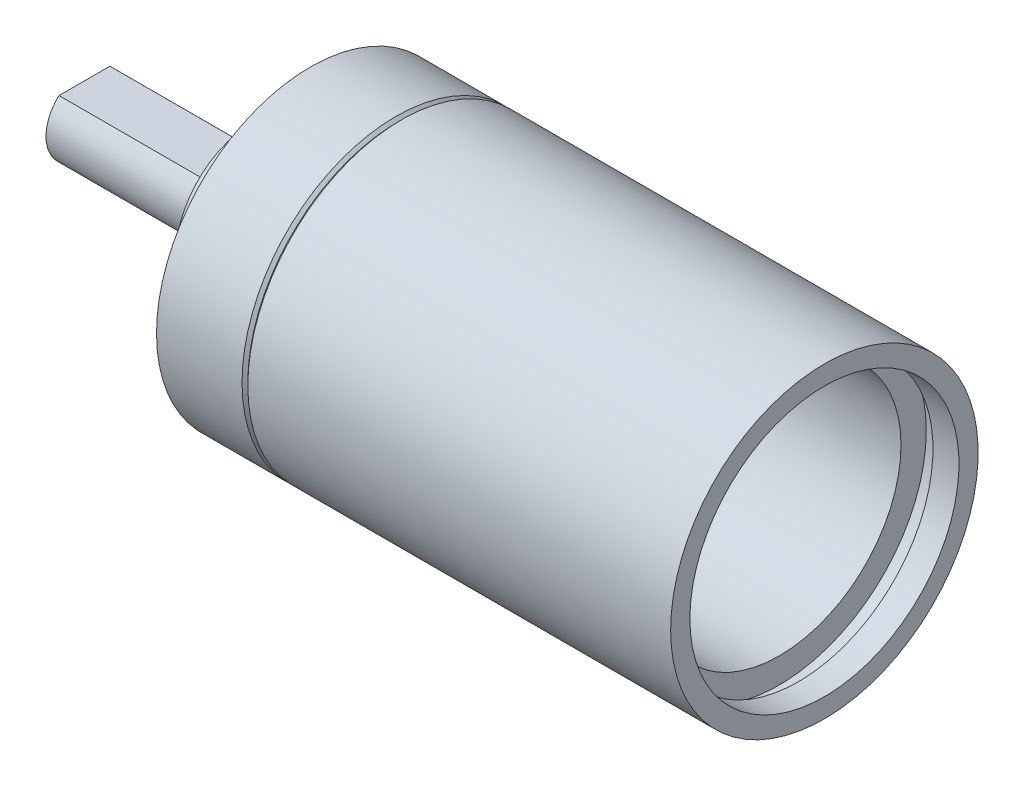
ISO-10303-21;
HEADER;
FILE_DESCRIPTION(('STEP AP214'),'2;1');
FILE_NAME('part.step','',(''),(''),'','','');
FILE_SCHEMA(('AUTOMOTIVE_DESIGN { 1 0 10303 214 1 1 1 1 }'));
ENDSEC;
DATA;
#1=APPLICATION_CONTEXT('core data for automotive mechanical design processes');
#2=APPLICATION_PROTOCOL_DEFINITION('international standard','automotive_design',2000,#1);
#3=PRODUCT_CONTEXT('',#1,'mechanical');
#4=PRODUCT('Part','Part','',(#3));
#5=PRODUCT_RELATED_PRODUCT_CATEGORY('part','',(#4));
#6=PRODUCT_DEFINITION_FORMATION('','',#4);
#7=PRODUCT_DEFINITION_CONTEXT('part definition',#1,'design');
#8=PRODUCT_DEFINITION('design','',#6,#7);
#9=PRODUCT_DEFINITION_SHAPE('','',#8);
#10=(LENGTH_UNIT() NAMED_UNIT(*) SI_UNIT(.MILLI.,.METRE.));
#11=(NAMED_UNIT(*) PLANE_ANGLE_UNIT() SI_UNIT($,.RADIAN.));
#12=(NAMED_UNIT(*) SI_UNIT($,.STERADIAN.) SOLID_ANGLE_UNIT());
#13=UNCERTAINTY_MEASURE_WITH_UNIT(LENGTH_MEASURE(1.E-05),#10,'distance_accuracy_value','');
#14=(GEOMETRIC_REPRESENTATION_CONTEXT(3) GLOBAL_UNCERTAINTY_ASSIGNED_CONTEXT((#13)) GLOBAL_UNIT_ASSIGNED_CONTEXT((#10,
#11,#12)) REPRESENTATION_CONTEXT('',''));
#15=CARTESIAN_POINT('',(0.,0.,0.));
#16=DIRECTION('',(0.,0.,1.));
#17=DIRECTION('',(1.,0.,0.));
#18=AXIS2_PLACEMENT_3D('',#15,#16,#17);
#19=CARTESIAN_POINT('',(-30.5,1.5,-5.));
#20=DIRECTION('',(0.707106781186548,-0.707106781186548,0.));
#21=DIRECTION('',(0.707106781186548,0.707106781186547,0.));
#22=AXIS2_PLACEMENT_3D('',#19,#20,#21);
#23=PLANE('',#22);
#24=CARTESIAN_POINT('',(-32.,0.,0.));
#25=DIRECTION('',(0.707106781186548,-0.707106781186548,0.));
#26=DIRECTION('',(-0.707106781186548,-0.707106781186547,0.));
#27=AXIS2_PLACEMENT_3D('',#24,#25,#26);
#28=ELLIPSE('',#27,2.82842712474619,2.);
#29=CARTESIAN_POINT('',(-30.5,1.50000000000007,-1.32287565553222));
#30=VERTEX_POINT('',#29);
#31=CARTESIAN_POINT('',(-30.5,1.50000000000007,1.32287565553221));
#32=VERTEX_POINT('',#31);
#33=EDGE_CURVE('E19',#30,#32,#28,.T.);
#34=ORIENTED_EDGE('',*,*,#33,.F.);
#35=DIRECTION('',(0.,0.,-1.));
#36=VECTOR('',#35,1.);
#37=CARTESIAN_POINT('',(-30.5,1.5,-5.));
#38=LINE('',#37,#36);
#39=EDGE_CURVE('E60',#30,#32,#38,.F.);
#40=ORIENTED_EDGE('',*,*,#39,.T.);
#41=EDGE_LOOP('',(#34,#40));
#42=FACE_BOUND('',#41,.T.);
#43=ADVANCED_FACE('F16',(#42),#23,.F.);
#44=CARTESIAN_POINT('',(-38.5000000000001,0.,0.));
#45=DIRECTION('',(-1.,0.,0.));
#46=DIRECTION('',(0.,0.,1.));
#47=AXIS2_PLACEMENT_3D('',#44,#45,#46);
#48=PLANE('',#47);
#49=CARTESIAN_POINT('',(-38.5000000000001,0.,0.));
#50=DIRECTION('',(-1.,0.,0.));
#51=DIRECTION('',(0.,0.,1.));
#52=AXIS2_PLACEMENT_3D('',#49,#50,#51);
#53=CIRCLE('',#52,2.);
#54=CARTESIAN_POINT('',(-38.5,1.50000000000007,1.32287565553221));
#55=VERTEX_POINT('',#54);
#56=CARTESIAN_POINT('',(-38.5,1.50000000000006,-1.32287565553221));
#57=VERTEX_POINT('',#56);
#58=EDGE_CURVE('E72',#55,#57,#53,.F.);
#59=ORIENTED_EDGE('',*,*,#58,.F.);
#60=DIRECTION('',(0.,0.,-1.));
#61=VECTOR('',#60,1.);
#62=CARTESIAN_POINT('',(-38.5,1.5,-5.));
#63=LINE('',#62,#61);
#64=EDGE_CURVE('E69',#55,#57,#63,.T.);
#65=ORIENTED_EDGE('',*,*,#64,.T.);
#66=EDGE_LOOP('',(#59,#65));
#67=FACE_BOUND('',#66,.T.);
#68=ADVANCED_FACE('F395',(#67),#48,.T.);
#69=CARTESIAN_POINT('',(-38.5,1.5,-5.));
#70=DIRECTION('',(0.,-1.,0.));
#71=DIRECTION('',(0.,0.,-1.));
#72=AXIS2_PLACEMENT_3D('',#69,#70,#71);
#73=PLANE('',#72);
#74=DIRECTION('',(-1.,0.,0.));
#75=VECTOR('',#74,1.);
#76=CARTESIAN_POINT('',(1.92500000000001,1.50000000000014,1.32287565553212));
#77=LINE('',#76,#75);
#78=EDGE_CURVE('E68',#32,#55,#77,.T.);
#79=ORIENTED_EDGE('',*,*,#78,.F.);
#80=ORIENTED_EDGE('',*,*,#39,.F.);
#81=DIRECTION('',(-1.,0.,0.));
#82=VECTOR('',#81,1.);
#83=CARTESIAN_POINT('',(1.92499999999995,1.50000000000014,-1.32287565553214));
#84=LINE('',#83,#82);
#85=EDGE_CURVE('E66',#57,#30,#84,.F.);
#86=ORIENTED_EDGE('',*,*,#85,.F.);
#87=ORIENTED_EDGE('',*,*,#64,.F.);
#88=EDGE_LOOP('',(#79,#80,#86,#87));
#89=FACE_BOUND('',#88,.T.);
#90=ADVANCED_FACE('F64',(#89),#73,.F.);
#91=CARTESIAN_POINT('',(1.92499999999995,0.,0.));
#92=DIRECTION('',(-1.,0.,0.));
#93=DIRECTION('',(0.,0.,1.));
#94=AXIS2_PLACEMENT_3D('',#91,#92,#93);
#95=CYLINDRICAL_SURFACE('',#94,2.);
#96=CARTESIAN_POINT('',(-29.7500000000001,0.,0.));
#97=DIRECTION('',(-1.,0.,0.));
#98=DIRECTION('',(0.,0.,1.));
#99=AXIS2_PLACEMENT_3D('',#96,#97,#98);
#100=CIRCLE('',#99,2.);
#101=CARTESIAN_POINT('',(-29.7500000000001,0.,1.99999999999999));
#102=VERTEX_POINT('',#101);
#103=EDGE_CURVE('E73',#102,#102,#100,.F.);
#104=ORIENTED_EDGE('',*,*,#103,.F.);
#105=EDGE_LOOP('',(#104));
#106=FACE_BOUND('',#105,.T.);
#107=ORIENTED_EDGE('',*,*,#58,.T.);
#108=ORIENTED_EDGE('',*,*,#85,.T.);
#109=ORIENTED_EDGE('',*,*,#33,.T.);
#110=ORIENTED_EDGE('',*,*,#78,.T.);
#111=EDGE_LOOP('',(#107,#108,#109,#110));
#112=FACE_BOUND('',#111,.T.);
#113=ADVANCED_FACE('F71',(#106,#112),#95,.T.);
#114=CARTESIAN_POINT('',(-29.7500000000001,0.,0.));
#115=DIRECTION('',(-1.,0.,0.));
#116=DIRECTION('',(0.,0.,1.));
#117=AXIS2_PLACEMENT_3D('',#114,#115,#116);
#118=PLANE('',#117);
#119=ORIENTED_EDGE('',*,*,#103,.T.);
#120=EDGE_LOOP('',(#119));
#121=FACE_BOUND('',#120,.T.);
#122=CARTESIAN_POINT('',(-29.7500000000001,0.,0.));
#123=DIRECTION('',(-1.,0.,0.));
#124=DIRECTION('',(0.,0.,1.));
#125=AXIS2_PLACEMENT_3D('',#122,#123,#124);
#126=CIRCLE('',#125,4.);
#127=CARTESIAN_POINT('',(-29.7500000000001,0.,3.99999999999999));
#128=VERTEX_POINT('',#127);
#129=EDGE_CURVE('E76',#128,#128,#126,.F.);
#130=ORIENTED_EDGE('',*,*,#129,.F.);
#131=EDGE_LOOP('',(#130));
#132=FACE_BOUND('',#131,.T.);
#133=ADVANCED_FACE('F143',(#121,#132),#118,.T.);
#134=CARTESIAN_POINT('',(-21.7000000000001,0.,0.));
#135=DIRECTION('',(-1.,0.,0.));
#136=DIRECTION('',(0.,0.,1.));
#137=AXIS2_PLACEMENT_3D('',#134,#135,#136);
#138=PLANE('',#137);
#139=CARTESIAN_POINT('',(-21.7000000000001,0.,0.));
#140=DIRECTION('',(-1.,0.,0.));
#141=DIRECTION('',(0.,0.,1.));
#142=AXIS2_PLACEMENT_3D('',#139,#140,#141);
#143=CIRCLE('',#142,6.335);
#144=CARTESIAN_POINT('',(-21.7000000000001,0.,6.33499999999999));
#145=VERTEX_POINT('',#144);
#146=EDGE_CURVE('E134',#145,#145,#143,.F.);
#147=ORIENTED_EDGE('',*,*,#146,.T.);
#148=EDGE_LOOP('',(#147));
#149=FACE_BOUND('',#148,.T.);
#150=ADVANCED_FACE('F145',(#149),#138,.F.);
#151=CARTESIAN_POINT('',(1.92499999999995,0.,0.));
#152=DIRECTION('',(-1.,0.,0.));
#153=DIRECTION('',(0.,0.,1.));
#154=AXIS2_PLACEMENT_3D('',#151,#152,#153);
#155=CYLINDRICAL_SURFACE('',#154,4.);
#156=ORIENTED_EDGE('',*,*,#129,.T.);
#157=EDGE_LOOP('',(#156));
#158=FACE_BOUND('',#157,.T.);
#159=CARTESIAN_POINT('',(-27.9,0.,0.));
#160=DIRECTION('',(-1.,0.,0.));
#161=DIRECTION('',(0.,0.,1.));
#162=AXIS2_PLACEMENT_3D('',#159,#160,#161);
#163=CIRCLE('',#162,4.);
#164=CARTESIAN_POINT('',(-27.9,0.,3.99999999999999));
#165=VERTEX_POINT('',#164);
#166=EDGE_CURVE('E131',#165,#165,#163,.F.);
#167=ORIENTED_EDGE('',*,*,#166,.F.);
#168=EDGE_LOOP('',(#167));
#169=FACE_BOUND('',#168,.T.);
#170=ADVANCED_FACE('F140',(#158,#169),#155,.T.);
#171=CARTESIAN_POINT('',(1.92499999999995,0.,0.));
#172=DIRECTION('',(-1.,0.,0.));
#173=DIRECTION('',(0.,0.,1.));
#174=AXIS2_PLACEMENT_3D('',#171,#172,#173);
#175=CYLINDRICAL_SURFACE('',#174,6.335);
#176=CARTESIAN_POINT('',(-2.35000000000002,0.,0.));
#177=DIRECTION('',(-1.,0.,0.));
#178=DIRECTION('',(0.,0.,1.));
#179=AXIS2_PLACEMENT_3D('',#176,#177,#178);
#180=CIRCLE('',#179,6.335);
#181=CARTESIAN_POINT('',(-2.35000000000002,0.,6.33499999999999));
#182=VERTEX_POINT('',#181);
#183=EDGE_CURVE('E128',#182,#182,#180,.F.);
#184=ORIENTED_EDGE('',*,*,#183,.T.);
#185=EDGE_LOOP('',(#184));
#186=FACE_BOUND('',#185,.T.);
#187=ORIENTED_EDGE('',*,*,#146,.F.);
#188=EDGE_LOOP('',(#187));
#189=FACE_BOUND('',#188,.T.);
#190=ADVANCED_FACE('F256',(#186,#189),#175,.F.);
#191=CARTESIAN_POINT('',(-27.9,0.,0.));
#192=DIRECTION('',(-1.,0.,0.));
#193=DIRECTION('',(0.,0.,1.));
#194=AXIS2_PLACEMENT_3D('',#191,#192,#193);
#195=PLANE('',#194);
#196=ORIENTED_EDGE('',*,*,#166,.T.);
#197=EDGE_LOOP('',(#196));
#198=FACE_BOUND('',#197,.T.);
#199=CARTESIAN_POINT('',(-27.9,0.,0.));
#200=DIRECTION('',(-1.,0.,0.));
#201=DIRECTION('',(0.,0.,1.));
#202=AXIS2_PLACEMENT_3D('',#199,#200,#201);
#203=CIRCLE('',#202,5.);
#204=CARTESIAN_POINT('',(-27.9,0.,4.99999999999999));
#205=VERTEX_POINT('',#204);
#206=EDGE_CURVE('E125',#205,#205,#203,.F.);
#207=ORIENTED_EDGE('',*,*,#206,.F.);
#208=EDGE_LOOP('',(#207));
#209=FACE_BOUND('',#208,.T.);
#210=ADVANCED_FACE('F252',(#198,#209),#195,.T.);
#211=CARTESIAN_POINT('',(-22.8727487385641,6.5,0.));
#212=DIRECTION('',(-1.,0.,0.));
#213=DIRECTION('',(0.,0.,1.));
#214=AXIS2_PLACEMENT_3D('',#211,#212,#213);
#215=CONICAL_SURFACE('',#214,0.869999999980336,1.02974425839299);
#216=CARTESIAN_POINT('',(-22.8727487385501,6.5,0.));
#217=DIRECTION('',(1.,0.,0.));
#218=DIRECTION('',(0.,0.,-1.));
#219=AXIS2_PLACEMENT_3D('',#216,#217,#218);
#220=CIRCLE('',#219,0.87);
#221=CARTESIAN_POINT('',(-22.8727487385501,6.5,-0.870000000000007));
#222=VERTEX_POINT('',#221);
#223=EDGE_CURVE('E80',#222,#222,#220,.F.);
#224=ORIENTED_EDGE('',*,*,#223,.T.);
#225=EDGE_LOOP('',(#224));
#226=FACE_BOUND('',#225,.T.);
#227=CARTESIAN_POINT('',(-22.3499999999604,6.49999999973261,0.));
#228=VERTEX_POINT('',#227);
#229=VERTEX_LOOP('',#228);
#230=FACE_BOUND('',#229,.T.);
#231=ADVANCED_FACE('F248',(#226,#230),#215,.F.);
#232=CARTESIAN_POINT('',(-22.8727487385072,3.25,5.629165124599));
#233=DIRECTION('',(-1.,0.,0.));
#234=DIRECTION('',(0.,0.,1.));
#235=AXIS2_PLACEMENT_3D('',#232,#233,#234);
#236=CONICAL_SURFACE('',#235,0.869999999887644,1.02974425842671);
#237=CARTESIAN_POINT('',(-22.8727487385501,3.25,5.629165124599));
#238=DIRECTION('',(1.,0.,0.));
#239=DIRECTION('',(0.,0.,-1.));
#240=AXIS2_PLACEMENT_3D('',#237,#238,#239);
#241=CIRCLE('',#240,0.87);
#242=CARTESIAN_POINT('',(-22.8727487385501,3.25,4.759165124599));
#243=VERTEX_POINT('',#242);
#244=EDGE_CURVE('E687',#243,#243,#241,.F.);
#245=ORIENTED_EDGE('',*,*,#244,.T.);
#246=EDGE_LOOP('',(#245));
#247=FACE_BOUND('',#246,.T.);
#248=CARTESIAN_POINT('',(-22.3499999999603,3.25000000005683,5.62916512468426));
#249=VERTEX_POINT('',#248);
#250=VERTEX_LOOP('',#249);
#251=FACE_BOUND('',#250,.T.);
#252=ADVANCED_FACE('F244',(#247,#251),#236,.F.);
#253=CARTESIAN_POINT('',(-22.8727487385072,-3.25,5.62916512459899));
#254=DIRECTION('',(-1.,0.,0.));
#255=DIRECTION('',(0.,0.,1.));
#256=AXIS2_PLACEMENT_3D('',#253,#254,#255);
#257=CONICAL_SURFACE('',#256,0.869999999887644,1.02974425842671);
#258=CARTESIAN_POINT('',(-22.8727487385501,-3.25000000000001,5.62916512459899));
#259=DIRECTION('',(1.,0.,0.));
#260=DIRECTION('',(0.,0.,-1.));
#261=AXIS2_PLACEMENT_3D('',#258,#259,#260);
#262=CIRCLE('',#261,0.87);
#263=CARTESIAN_POINT('',(-22.8727487385501,-3.25000000000001,4.75916512459899));
#264=VERTEX_POINT('',#263);
#265=EDGE_CURVE('E685',#264,#264,#262,.F.);
#266=ORIENTED_EDGE('',*,*,#265,.T.);
#267=EDGE_LOOP('',(#266));
#268=FACE_BOUND('',#267,.T.);
#269=CARTESIAN_POINT('',(-22.3499999999035,-3.25,5.629165124599));
#270=VERTEX_POINT('',#269);
#271=VERTEX_LOOP('',#270);
#272=FACE_BOUND('',#271,.T.);
#273=ADVANCED_FACE('F240',(#268,#272),#257,.F.);
#274=CARTESIAN_POINT('',(-22.872748738564,-6.5,0.));
#275=DIRECTION('',(-1.,0.,0.));
#276=DIRECTION('',(0.,0.,1.));
#277=AXIS2_PLACEMENT_3D('',#274,#275,#276);
#278=CONICAL_SURFACE('',#277,0.869999999980336,1.02974425839299);
#279=CARTESIAN_POINT('',(-22.8727487385501,-6.50000000000001,0.));
#280=DIRECTION('',(1.,0.,0.));
#281=DIRECTION('',(0.,0.,-1.));
#282=AXIS2_PLACEMENT_3D('',#279,#280,#281);
#283=CIRCLE('',#282,0.87);
#284=CARTESIAN_POINT('',(-22.8727487385501,-6.50000000000001,-0.87));
#285=VERTEX_POINT('',#284);
#286=EDGE_CURVE('E682',#285,#285,#283,.F.);
#287=ORIENTED_EDGE('',*,*,#286,.T.);
#288=EDGE_LOOP('',(#287));
#289=FACE_BOUND('',#288,.T.);
#290=CARTESIAN_POINT('',(-22.3499999999603,-6.49999999973261,0.));
#291=VERTEX_POINT('',#290);
#292=VERTEX_LOOP('',#291);
#293=FACE_BOUND('',#292,.T.);
#294=ADVANCED_FACE('F236',(#289,#293),#278,.F.);
#295=CARTESIAN_POINT('',(-22.8727487385073,-3.25,-5.62916512459901));
#296=DIRECTION('',(-1.,0.,0.));
#297=DIRECTION('',(0.,0.,1.));
#298=AXIS2_PLACEMENT_3D('',#295,#296,#297);
#299=CONICAL_SURFACE('',#298,0.869999999887644,1.02974425842671);
#300=CARTESIAN_POINT('',(-22.8727487385501,-3.25,-5.629165124599));
#301=DIRECTION('',(1.,0.,0.));
#302=DIRECTION('',(0.,0.,-1.));
#303=AXIS2_PLACEMENT_3D('',#300,#301,#302);
#304=CIRCLE('',#303,0.87);
#305=CARTESIAN_POINT('',(-22.8727487385501,-3.25,-6.499165124599));
#306=VERTEX_POINT('',#305);
#307=EDGE_CURVE('E679',#306,#306,#304,.F.);
#308=ORIENTED_EDGE('',*,*,#307,.T.);
#309=EDGE_LOOP('',(#308));
#310=FACE_BOUND('',#309,.T.);
#311=CARTESIAN_POINT('',(-22.3499999999603,-3.25000000005685,-5.62916512468427));
#312=VERTEX_POINT('',#311);
#313=VERTEX_LOOP('',#312);
#314=FACE_BOUND('',#313,.T.);
#315=ADVANCED_FACE('F232',(#310,#314),#299,.F.);
#316=CARTESIAN_POINT('',(-22.8727487385073,3.25,-5.629165124599));
#317=DIRECTION('',(-1.,0.,0.));
#318=DIRECTION('',(0.,0.,1.));
#319=AXIS2_PLACEMENT_3D('',#316,#317,#318);
#320=CONICAL_SURFACE('',#319,0.869999999887644,1.02974425842671);
#321=CARTESIAN_POINT('',(-22.8727487385501,3.25,-5.62916512459901));
#322=DIRECTION('',(1.,0.,0.));
#323=DIRECTION('',(0.,0.,-1.));
#324=AXIS2_PLACEMENT_3D('',#321,#322,#323);
#325=CIRCLE('',#324,0.87);
#326=CARTESIAN_POINT('',(-22.8727487385501,3.25,-6.49916512459901));
#327=VERTEX_POINT('',#326);
#328=EDGE_CURVE('E124',#327,#327,#325,.F.);
#329=ORIENTED_EDGE('',*,*,#328,.T.);
#330=EDGE_LOOP('',(#329));
#331=FACE_BOUND('',#330,.T.);
#332=CARTESIAN_POINT('',(-22.3499999999035,3.25,-5.629165124599));
#333=VERTEX_POINT('',#332);
#334=VERTEX_LOOP('',#333);
#335=FACE_BOUND('',#334,.T.);
#336=ADVANCED_FACE('F228',(#331,#335),#320,.F.);
#337=CARTESIAN_POINT('',(-2.35000000000002,0.,0.));
#338=DIRECTION('',(-1.,0.,0.));
#339=DIRECTION('',(0.,0.,1.));
#340=AXIS2_PLACEMENT_3D('',#337,#338,#339);
#341=PLANE('',#340);
#342=ORIENTED_EDGE('',*,*,#183,.F.);
#343=EDGE_LOOP('',(#342));
#344=FACE_BOUND('',#343,.T.);
#345=CARTESIAN_POINT('',(-2.35000000000002,0.,0.));
#346=DIRECTION('',(-1.,0.,0.));
#347=DIRECTION('',(0.,0.,1.));
#348=AXIS2_PLACEMENT_3D('',#345,#346,#347);
#349=CIRCLE('',#348,7.65);
#350=CARTESIAN_POINT('',(-2.35000000000002,0.,7.64999999999999));
#351=VERTEX_POINT('',#350);
#352=EDGE_CURVE('E121',#351,#351,#349,.F.);
#353=ORIENTED_EDGE('',*,*,#352,.T.);
#354=EDGE_LOOP('',(#353));
#355=FACE_BOUND('',#354,.T.);
#356=ADVANCED_FACE('F224',(#344,#355),#341,.F.);
#357=CARTESIAN_POINT('',(1.92499999999995,0.,0.));
#358=DIRECTION('',(-1.,0.,0.));
#359=DIRECTION('',(0.,0.,1.));
#360=AXIS2_PLACEMENT_3D('',#357,#358,#359);
#361=CYLINDRICAL_SURFACE('',#360,5.);
#362=ORIENTED_EDGE('',*,*,#206,.T.);
#363=EDGE_LOOP('',(#362));
#364=FACE_BOUND('',#363,.T.);
#365=CARTESIAN_POINT('',(-26.75,0.,0.));
#366=DIRECTION('',(-1.,0.,0.));
#367=DIRECTION('',(0.,0.,1.));
#368=AXIS2_PLACEMENT_3D('',#365,#366,#367);
#369=CIRCLE('',#368,5.);
#370=CARTESIAN_POINT('',(-26.75,0.,4.99999999999999));
#371=VERTEX_POINT('',#370);
#372=EDGE_CURVE('E118',#371,#371,#369,.F.);
#373=ORIENTED_EDGE('',*,*,#372,.F.);
#374=EDGE_LOOP('',(#373));
#375=FACE_BOUND('',#374,.T.);
#376=ADVANCED_FACE('F220',(#364,#375),#361,.T.);
#377=CARTESIAN_POINT('',(-26.97,6.5,0.));
#378=DIRECTION('',(1.,0.,0.));
#379=DIRECTION('',(0.,0.,-1.));
#380=AXIS2_PLACEMENT_3D('',#377,#378,#379);
#381=CYLINDRICAL_SURFACE('',#380,0.87);
#382=ORIENTED_EDGE('',*,*,#223,.F.);
#383=EDGE_LOOP('',(#382));
#384=FACE_BOUND('',#383,.T.);
#385=CARTESIAN_POINT('',(-26.75,6.5,0.));
#386=DIRECTION('',(1.,0.,0.));
#387=DIRECTION('',(0.,0.,-1.));
#388=AXIS2_PLACEMENT_3D('',#385,#386,#387);
#389=CIRCLE('',#388,0.87);
#390=CARTESIAN_POINT('',(-26.75,6.5,-0.870000000000007));
#391=VERTEX_POINT('',#390);
#392=EDGE_CURVE('E115',#391,#391,#389,.T.);
#393=ORIENTED_EDGE('',*,*,#392,.F.);
#394=EDGE_LOOP('',(#393));
#395=FACE_BOUND('',#394,.T.);
#396=ADVANCED_FACE('F216',(#384,#395),#381,.F.);
#397=CARTESIAN_POINT('',(-26.97,3.25,5.62916512459898));
#398=DIRECTION('',(1.,0.,0.));
#399=DIRECTION('',(0.,0.,-1.));
#400=AXIS2_PLACEMENT_3D('',#397,#398,#399);
#401=CYLINDRICAL_SURFACE('',#400,0.87);
#402=CARTESIAN_POINT('',(-26.75,3.25,5.629165124599));
#403=DIRECTION('',(1.,0.,0.));
#404=DIRECTION('',(0.,0.,-1.));
#405=AXIS2_PLACEMENT_3D('',#402,#403,#404);
#406=CIRCLE('',#405,0.87);
#407=CARTESIAN_POINT('',(-26.75,3.25,4.759165124599));
#408=VERTEX_POINT('',#407);
#409=EDGE_CURVE('E112',#408,#408,#406,.T.);
#410=ORIENTED_EDGE('',*,*,#409,.F.);
#411=EDGE_LOOP('',(#410));
#412=FACE_BOUND('',#411,.T.);
#413=ORIENTED_EDGE('',*,*,#244,.F.);
#414=EDGE_LOOP('',(#413));
#415=FACE_BOUND('',#414,.T.);
#416=ADVANCED_FACE('F212',(#412,#415),#401,.F.);
#417=CARTESIAN_POINT('',(-26.97,-3.25000000000001,5.629165124599));
#418=DIRECTION('',(1.,0.,0.));
#419=DIRECTION('',(0.,0.,-1.));
#420=AXIS2_PLACEMENT_3D('',#417,#418,#419);
#421=CYLINDRICAL_SURFACE('',#420,0.87);
#422=CARTESIAN_POINT('',(-26.75,-3.25,5.629165124599));
#423=DIRECTION('',(1.,0.,0.));
#424=DIRECTION('',(0.,0.,-1.));
#425=AXIS2_PLACEMENT_3D('',#422,#423,#424);
#426=CIRCLE('',#425,0.87);
#427=CARTESIAN_POINT('',(-26.75,-3.25,4.759165124599));
#428=VERTEX_POINT('',#427);
#429=EDGE_CURVE('E109',#428,#428,#426,.T.);
#430=ORIENTED_EDGE('',*,*,#429,.F.);
#431=EDGE_LOOP('',(#430));
#432=FACE_BOUND('',#431,.T.);
#433=ORIENTED_EDGE('',*,*,#265,.F.);
#434=EDGE_LOOP('',(#433));
#435=FACE_BOUND('',#434,.T.);
#436=ADVANCED_FACE('F208',(#432,#435),#421,.F.);
#437=CARTESIAN_POINT('',(-26.97,-6.5,0.));
#438=DIRECTION('',(1.,0.,0.));
#439=DIRECTION('',(0.,0.,-1.));
#440=AXIS2_PLACEMENT_3D('',#437,#438,#439);
#441=CYLINDRICAL_SURFACE('',#440,0.87);
#442=CARTESIAN_POINT('',(-26.75,-6.50000000000001,0.));
#443=DIRECTION('',(1.,0.,0.));
#444=DIRECTION('',(0.,0.,-1.));
#445=AXIS2_PLACEMENT_3D('',#442,#443,#444);
#446=CIRCLE('',#445,0.87);
#447=CARTESIAN_POINT('',(-26.75,-6.50000000000001,-0.87));
#448=VERTEX_POINT('',#447);
#449=EDGE_CURVE('E106',#448,#448,#446,.T.);
#450=ORIENTED_EDGE('',*,*,#449,.F.);
#451=EDGE_LOOP('',(#450));
#452=FACE_BOUND('',#451,.T.);
#453=ORIENTED_EDGE('',*,*,#286,.F.);
#454=EDGE_LOOP('',(#453));
#455=FACE_BOUND('',#454,.T.);
#456=ADVANCED_FACE('F204',(#452,#455),#441,.F.);
#457=CARTESIAN_POINT('',(-26.97,-3.25000000000001,-5.629165124599));
#458=DIRECTION('',(1.,0.,0.));
#459=DIRECTION('',(0.,0.,-1.));
#460=AXIS2_PLACEMENT_3D('',#457,#458,#459);
#461=CYLINDRICAL_SURFACE('',#460,0.87);
#462=CARTESIAN_POINT('',(-26.75,-3.25,-5.629165124599));
#463=DIRECTION('',(1.,0.,0.));
#464=DIRECTION('',(0.,0.,-1.));
#465=AXIS2_PLACEMENT_3D('',#462,#463,#464);
#466=CIRCLE('',#465,0.87);
#467=CARTESIAN_POINT('',(-26.75,-3.25,-6.499165124599));
#468=VERTEX_POINT('',#467);
#469=EDGE_CURVE('E103',#468,#468,#466,.T.);
#470=ORIENTED_EDGE('',*,*,#469,.F.);
#471=EDGE_LOOP('',(#470));
#472=FACE_BOUND('',#471,.T.);
#473=ORIENTED_EDGE('',*,*,#307,.F.);
#474=EDGE_LOOP('',(#473));
#475=FACE_BOUND('',#474,.T.);
#476=ADVANCED_FACE('F200',(#472,#475),#461,.F.);
#477=CARTESIAN_POINT('',(-26.97,3.25,-5.629165124599));
#478=DIRECTION('',(1.,0.,0.));
#479=DIRECTION('',(0.,0.,-1.));
#480=AXIS2_PLACEMENT_3D('',#477,#478,#479);
#481=CYLINDRICAL_SURFACE('',#480,0.87);
#482=CARTESIAN_POINT('',(-26.75,3.25,-5.62916512459901));
#483=DIRECTION('',(1.,0.,0.));
#484=DIRECTION('',(0.,0.,-1.));
#485=AXIS2_PLACEMENT_3D('',#482,#483,#484);
#486=CIRCLE('',#485,0.87);
#487=CARTESIAN_POINT('',(-26.75,3.25,-6.49916512459901));
#488=VERTEX_POINT('',#487);
#489=EDGE_CURVE('E100',#488,#488,#486,.T.);
#490=ORIENTED_EDGE('',*,*,#489,.F.);
#491=EDGE_LOOP('',(#490));
#492=FACE_BOUND('',#491,.T.);
#493=ORIENTED_EDGE('',*,*,#328,.F.);
#494=EDGE_LOOP('',(#493));
#495=FACE_BOUND('',#494,.T.);
#496=ADVANCED_FACE('F196',(#492,#495),#481,.F.);
#497=CARTESIAN_POINT('',(1.92499999999995,0.,0.));
#498=DIRECTION('',(-1.,0.,0.));
#499=DIRECTION('',(0.,0.,1.));
#500=AXIS2_PLACEMENT_3D('',#497,#498,#499);
#501=CYLINDRICAL_SURFACE('',#500,7.65);
#502=ORIENTED_EDGE('',*,*,#352,.F.);
#503=EDGE_LOOP('',(#502));
#504=FACE_BOUND('',#503,.T.);
#505=CARTESIAN_POINT('',(-1.35000000000002,0.,0.));
#506=DIRECTION('',(-1.,0.,0.));
#507=DIRECTION('',(0.,0.,1.));
#508=AXIS2_PLACEMENT_3D('',#505,#506,#507);
#509=CIRCLE('',#508,7.65);
#510=CARTESIAN_POINT('',(-1.35000000000002,0.,7.65));
#511=VERTEX_POINT('',#510);
#512=EDGE_CURVE('E97',#511,#511,#509,.T.);
#513=ORIENTED_EDGE('',*,*,#512,.F.);
#514=EDGE_LOOP('',(#513));
#515=FACE_BOUND('',#514,.T.);
#516=ADVANCED_FACE('F192',(#504,#515),#501,.F.);
#517=CARTESIAN_POINT('',(-26.75,0.,0.));
#518=DIRECTION('',(-1.,0.,0.));
#519=DIRECTION('',(0.,0.,1.));
#520=AXIS2_PLACEMENT_3D('',#517,#518,#519);
#521=PLANE('',#520);
#522=ORIENTED_EDGE('',*,*,#489,.T.);
#523=EDGE_LOOP('',(#522));
#524=FACE_BOUND('',#523,.T.);
#525=ORIENTED_EDGE('',*,*,#469,.T.);
#526=EDGE_LOOP('',(#525));
#527=FACE_BOUND('',#526,.T.);
#528=ORIENTED_EDGE('',*,*,#449,.T.);
#529=EDGE_LOOP('',(#528));
#530=FACE_BOUND('',#529,.T.);
#531=ORIENTED_EDGE('',*,*,#429,.T.);
#532=EDGE_LOOP('',(#531));
#533=FACE_BOUND('',#532,.T.);
#534=ORIENTED_EDGE('',*,*,#409,.T.);
#535=EDGE_LOOP('',(#534));
#536=FACE_BOUND('',#535,.T.);
#537=ORIENTED_EDGE('',*,*,#392,.T.);
#538=EDGE_LOOP('',(#537));
#539=FACE_BOUND('',#538,.T.);
#540=ORIENTED_EDGE('',*,*,#372,.T.);
#541=EDGE_LOOP('',(#540));
#542=FACE_BOUND('',#541,.T.);
#543=CARTESIAN_POINT('',(-26.75,0.,0.));
#544=DIRECTION('',(-1.,0.,0.));
#545=DIRECTION('',(0.,0.,1.));
#546=AXIS2_PLACEMENT_3D('',#543,#544,#545);
#547=CIRCLE('',#546,8.);
#548=CARTESIAN_POINT('',(-26.75,0.,7.99999999999999));
#549=VERTEX_POINT('',#548);
#550=EDGE_CURVE('E94',#549,#549,#547,.F.);
#551=ORIENTED_EDGE('',*,*,#550,.F.);
#552=EDGE_LOOP('',(#551));
#553=FACE_BOUND('',#552,.T.);
#554=ADVANCED_FACE('F188',(#524,#527,#530,#533,#536,#539,#542,#553),#521,.T.);
#555=CARTESIAN_POINT('',(-1.35000000000002,0.,0.));
#556=DIRECTION('',(-1.,0.,0.));
#557=DIRECTION('',(0.,0.,1.));
#558=AXIS2_PLACEMENT_3D('',#555,#556,#557);
#559=PLANE('',#558);
#560=CARTESIAN_POINT('',(-1.35000000000002,0.,0.));
#561=DIRECTION('',(-1.,0.,0.));
#562=DIRECTION('',(0.,0.,1.));
#563=AXIS2_PLACEMENT_3D('',#560,#561,#562);
#564=CIRCLE('',#563,7.);
#565=CARTESIAN_POINT('',(-1.35000000000002,0.,7.));
#566=VERTEX_POINT('',#565);
#567=EDGE_CURVE('E91',#566,#566,#564,.F.);
#568=ORIENTED_EDGE('',*,*,#567,.T.);
#569=EDGE_LOOP('',(#568));
#570=FACE_BOUND('',#569,.T.);
#571=ORIENTED_EDGE('',*,*,#512,.T.);
#572=EDGE_LOOP('',(#571));
#573=FACE_BOUND('',#572,.T.);
#574=ADVANCED_FACE('F184',(#570,#573),#559,.T.);
#575=CARTESIAN_POINT('',(1.92499999999995,0.,0.));
#576=DIRECTION('',(-1.,0.,0.));
#577=DIRECTION('',(0.,0.,1.));
#578=AXIS2_PLACEMENT_3D('',#575,#576,#577);
#579=CYLINDRICAL_SURFACE('',#578,8.);
#580=ORIENTED_EDGE('',*,*,#550,.T.);
#581=EDGE_LOOP('',(#580));
#582=FACE_BOUND('',#581,.T.);
#583=CARTESIAN_POINT('',(-22.3,0.,0.));
#584=DIRECTION('',(-1.,0.,0.));
#585=DIRECTION('',(0.,1.,0.));
#586=AXIS2_PLACEMENT_3D('',#583,#584,#585);
#587=CIRCLE('',#586,7.99999999999999);
#588=CARTESIAN_POINT('',(-22.3,7.99999999999999,0.));
#589=VERTEX_POINT('',#588);
#590=EDGE_CURVE('E90',#589,#589,#587,.F.);
#591=ORIENTED_EDGE('',*,*,#590,.F.);
#592=EDGE_LOOP('',(#591));
#593=FACE_BOUND('',#592,.T.);
#594=ADVANCED_FACE('F180',(#582,#593),#579,.T.);
#595=CARTESIAN_POINT('',(1.92499999999995,0.,0.));
#596=DIRECTION('',(-1.,0.,0.));
#597=DIRECTION('',(0.,0.,1.));
#598=AXIS2_PLACEMENT_3D('',#595,#596,#597);
#599=CYLINDRICAL_SURFACE('',#598,7.);
#600=CARTESIAN_POINT('',(0.,0.,0.));
#601=DIRECTION('',(-1.,0.,0.));
#602=DIRECTION('',(0.,0.,1.));
#603=AXIS2_PLACEMENT_3D('',#600,#601,#602);
#604=CIRCLE('',#603,7.);
#605=CARTESIAN_POINT('',(0.,0.,7.));
#606=VERTEX_POINT('',#605);
#607=EDGE_CURVE('E87',#606,#606,#604,.F.);
#608=ORIENTED_EDGE('',*,*,#607,.T.);
#609=EDGE_LOOP('',(#608));
#610=FACE_BOUND('',#609,.T.);
#611=ORIENTED_EDGE('',*,*,#567,.F.);
#612=EDGE_LOOP('',(#611));
#613=FACE_BOUND('',#612,.T.);
#614=ADVANCED_FACE('F176',(#610,#613),#599,.F.);
#615=CARTESIAN_POINT('',(-22.3,0.,0.));
#616=DIRECTION('',(-1.,0.,0.));
#617=DIRECTION('',(0.,0.,1.));
#618=AXIS2_PLACEMENT_3D('',#615,#616,#617);
#619=CONICAL_SURFACE('',#618,7.99999999999999,0.785398163397298);
#620=ORIENTED_EDGE('',*,*,#590,.T.);
#621=EDGE_LOOP('',(#620));
#622=FACE_BOUND('',#621,.T.);
#623=CARTESIAN_POINT('',(-22.1500000000001,0.,0.));
#624=DIRECTION('',(1.,0.,0.));
#625=DIRECTION('',(0.,-1.,0.));
#626=AXIS2_PLACEMENT_3D('',#623,#624,#625);
#627=CIRCLE('',#626,7.85000000000001);
#628=CARTESIAN_POINT('',(-22.1500000000001,-7.85000000000001,0.));
#629=VERTEX_POINT('',#628);
#630=EDGE_CURVE('E86',#629,#629,#627,.T.);
#631=ORIENTED_EDGE('',*,*,#630,.F.);
#632=EDGE_LOOP('',(#631));
#633=FACE_BOUND('',#632,.T.);
#634=ADVANCED_FACE('F172',(#622,#633),#619,.T.);
#635=CARTESIAN_POINT('',(0.,0.,0.));
#636=DIRECTION('',(-1.,0.,0.));
#637=DIRECTION('',(0.,0.,1.));
#638=AXIS2_PLACEMENT_3D('',#635,#636,#637);
#639=PLANE('',#638);
#640=ORIENTED_EDGE('',*,*,#607,.F.);
#641=EDGE_LOOP('',(#640));
#642=FACE_BOUND('',#641,.T.);
#643=CARTESIAN_POINT('',(0.,0.,0.));
#644=DIRECTION('',(-1.,0.,0.));
#645=DIRECTION('',(0.,0.,1.));
#646=AXIS2_PLACEMENT_3D('',#643,#644,#645);
#647=CIRCLE('',#646,8.);
#648=CARTESIAN_POINT('',(0.,0.,8.));
#649=VERTEX_POINT('',#648);
#650=EDGE_CURVE('E25',#649,#649,#647,.T.);
#651=ORIENTED_EDGE('',*,*,#650,.F.);
#652=EDGE_LOOP('',(#651));
#653=FACE_BOUND('',#652,.T.);
#654=ADVANCED_FACE('F165',(#642,#653),#639,.F.);
#655=CARTESIAN_POINT('',(-22.,0.,0.));
#656=DIRECTION('',(1.,0.,0.));
#657=DIRECTION('',(0.,0.,-1.));
#658=AXIS2_PLACEMENT_3D('',#655,#656,#657);
#659=CONICAL_SURFACE('',#658,7.99999999999999,0.785398163397298);
#660=ORIENTED_EDGE('',*,*,#630,.T.);
#661=EDGE_LOOP('',(#660));
#662=FACE_BOUND('',#661,.T.);
#663=CARTESIAN_POINT('',(-22.,0.,0.));
#664=DIRECTION('',(-1.,0.,0.));
#665=DIRECTION('',(0.,0.,1.));
#666=AXIS2_PLACEMENT_3D('',#663,#664,#665);
#667=CIRCLE('',#666,8.);
#668=CARTESIAN_POINT('',(-22.,0.,7.99999999999999));
#669=VERTEX_POINT('',#668);
#670=EDGE_CURVE('E11',#669,#669,#667,.F.);
#671=ORIENTED_EDGE('',*,*,#670,.F.);
#672=EDGE_LOOP('',(#671));
#673=FACE_BOUND('',#672,.T.);
#674=ADVANCED_FACE('F159',(#662,#673),#659,.T.);
#675=CARTESIAN_POINT('',(1.92499999999995,0.,0.));
#676=DIRECTION('',(-1.,0.,0.));
#677=DIRECTION('',(0.,0.,1.));
#678=AXIS2_PLACEMENT_3D('',#675,#676,#677);
#679=CYLINDRICAL_SURFACE('',#678,8.);
#680=ORIENTED_EDGE('',*,*,#670,.T.);
#681=EDGE_LOOP('',(#680));
#682=FACE_BOUND('',#681,.T.);
#683=ORIENTED_EDGE('',*,*,#650,.T.);
#684=EDGE_LOOP('',(#683));
#685=FACE_BOUND('',#684,.T.);
#686=ADVANCED_FACE('F157',(#682,#685),#679,.T.);
#687=CLOSED_SHELL('',(#43,#68,#90,#113,#133,#150,#170,#190,#210,#231,#252,#273,#294,#315,#336,
#356,#376,#396,#416,#436,#456,#476,#496,#516,#554,#574,#594,#614,#634,#654,#674,#686));
#688=MANIFOLD_SOLID_BREP('B1',#687);
#689=ADVANCED_BREP_SHAPE_REPRESENTATION('',(#18,#688),#14);
#690=SHAPE_DEFINITION_REPRESENTATION(#9,#689);
ENDSEC;
END-ISO-10303-21;
